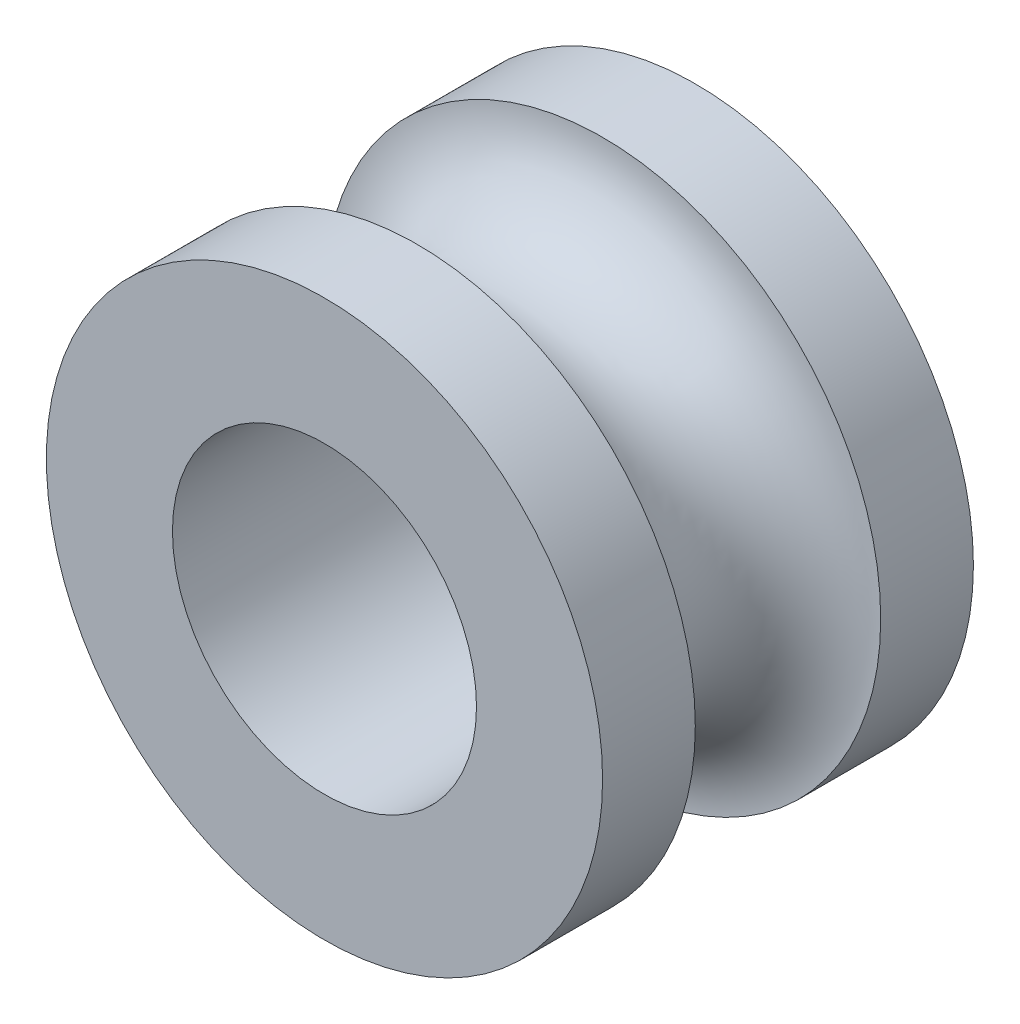
ISO-10303-21;
HEADER;
FILE_DESCRIPTION(('STEP AP214'),'2;1');
FILE_NAME('part.step','',(''),(''),'','','');
FILE_SCHEMA(('AUTOMOTIVE_DESIGN { 1 0 10303 214 1 1 1 1 }'));
ENDSEC;
DATA;
#1=APPLICATION_CONTEXT('core data for automotive mechanical design processes');
#2=APPLICATION_PROTOCOL_DEFINITION('international standard','automotive_design',2000,#1);
#3=PRODUCT_CONTEXT('',#1,'mechanical');
#4=PRODUCT('Part','Part','',(#3));
#5=PRODUCT_RELATED_PRODUCT_CATEGORY('part','',(#4));
#6=PRODUCT_DEFINITION_FORMATION('','',#4);
#7=PRODUCT_DEFINITION_CONTEXT('part definition',#1,'design');
#8=PRODUCT_DEFINITION('design','',#6,#7);
#9=PRODUCT_DEFINITION_SHAPE('','',#8);
#10=(LENGTH_UNIT() NAMED_UNIT(*) SI_UNIT(.MILLI.,.METRE.));
#11=(NAMED_UNIT(*) PLANE_ANGLE_UNIT() SI_UNIT($,.RADIAN.));
#12=(NAMED_UNIT(*) SI_UNIT($,.STERADIAN.) SOLID_ANGLE_UNIT());
#13=UNCERTAINTY_MEASURE_WITH_UNIT(LENGTH_MEASURE(1.E-05),#10,'distance_accuracy_value','');
#14=(GEOMETRIC_REPRESENTATION_CONTEXT(3) GLOBAL_UNCERTAINTY_ASSIGNED_CONTEXT((#13)) GLOBAL_UNIT_ASSIGNED_CONTEXT((#10,
#11,#12)) REPRESENTATION_CONTEXT('',''));
#15=CARTESIAN_POINT('',(0.,0.,0.));
#16=DIRECTION('',(0.,0.,1.));
#17=DIRECTION('',(1.,0.,0.));
#18=AXIS2_PLACEMENT_3D('',#15,#16,#17);
#19=CARTESIAN_POINT('',(0.,0.,2.5));
#20=DIRECTION('',(0.,0.,-1.));
#21=DIRECTION('',(-1.,0.,0.));
#22=AXIS2_PLACEMENT_3D('',#19,#20,#21);
#23=CYLINDRICAL_SURFACE('',#22,3.75);
#24=CARTESIAN_POINT('',(0.,0.,1.25));
#25=DIRECTION('',(0.,0.,-1.));
#26=DIRECTION('',(-1.,0.,0.));
#27=AXIS2_PLACEMENT_3D('',#24,#25,#26);
#28=CIRCLE('',#27,3.75);
#29=CARTESIAN_POINT('',(3.75,0.,1.25));
#30=VERTEX_POINT('',#29);
#31=EDGE_CURVE('E12',#30,#30,#28,.F.);
#32=ORIENTED_EDGE('',*,*,#31,.T.);
#33=EDGE_LOOP('',(#32));
#34=FACE_BOUND('',#33,.T.);
#35=CARTESIAN_POINT('',(0.,0.,2.5));
#36=DIRECTION('',(0.,0.,1.));
#37=DIRECTION('',(1.,0.,0.));
#38=AXIS2_PLACEMENT_3D('',#35,#36,#37);
#39=CIRCLE('',#38,3.75);
#40=CARTESIAN_POINT('',(3.75,0.,2.5));
#41=VERTEX_POINT('',#40);
#42=EDGE_CURVE('E74',#41,#41,#39,.T.);
#43=ORIENTED_EDGE('',*,*,#42,.F.);
#44=EDGE_LOOP('',(#43));
#45=FACE_BOUND('',#44,.T.);
#46=ADVANCED_FACE('F47',(#34,#45),#23,.T.);
#47=CARTESIAN_POINT('',(0.,0.,2.5));
#48=DIRECTION('',(0.,0.,1.));
#49=DIRECTION('',(1.,0.,0.));
#50=AXIS2_PLACEMENT_3D('',#47,#48,#49);
#51=PLANE('',#50);
#52=ORIENTED_EDGE('',*,*,#42,.T.);
#53=EDGE_LOOP('',(#52));
#54=FACE_BOUND('',#53,.T.);
#55=CARTESIAN_POINT('',(0.,0.,2.5));
#56=DIRECTION('',(0.,0.,1.));
#57=DIRECTION('',(1.,0.,0.));
#58=AXIS2_PLACEMENT_3D('',#55,#56,#57);
#59=CIRCLE('',#58,2.05);
#60=CARTESIAN_POINT('',(2.05,0.,2.5));
#61=VERTEX_POINT('',#60);
#62=EDGE_CURVE('E68',#61,#61,#59,.T.);
#63=ORIENTED_EDGE('',*,*,#62,.F.);
#64=EDGE_LOOP('',(#63));
#65=FACE_BOUND('',#64,.T.);
#66=ADVANCED_FACE('F87',(#54,#65),#51,.T.);
#67=CARTESIAN_POINT('',(0.,0.,-2.5));
#68=DIRECTION('',(0.,0.,1.));
#69=DIRECTION('',(1.,0.,0.));
#70=AXIS2_PLACEMENT_3D('',#67,#68,#69);
#71=PLANE('',#70);
#72=CARTESIAN_POINT('',(0.,0.,-2.5));
#73=DIRECTION('',(0.,0.,1.));
#74=DIRECTION('',(1.,0.,0.));
#75=AXIS2_PLACEMENT_3D('',#72,#73,#74);
#76=CIRCLE('',#75,3.75);
#77=CARTESIAN_POINT('',(3.75,0.,-2.5));
#78=VERTEX_POINT('',#77);
#79=EDGE_CURVE('E72',#78,#78,#76,.T.);
#80=ORIENTED_EDGE('',*,*,#79,.F.);
#81=EDGE_LOOP('',(#80));
#82=FACE_BOUND('',#81,.T.);
#83=CARTESIAN_POINT('',(0.,0.,-2.5));
#84=DIRECTION('',(0.,0.,1.));
#85=DIRECTION('',(1.,0.,0.));
#86=AXIS2_PLACEMENT_3D('',#83,#84,#85);
#87=CIRCLE('',#86,2.05);
#88=CARTESIAN_POINT('',(2.05,0.,-2.5));
#89=VERTEX_POINT('',#88);
#90=EDGE_CURVE('E65',#89,#89,#87,.T.);
#91=ORIENTED_EDGE('',*,*,#90,.T.);
#92=EDGE_LOOP('',(#91));
#93=FACE_BOUND('',#92,.T.);
#94=ADVANCED_FACE('F82',(#82,#93),#71,.F.);
#95=CARTESIAN_POINT('',(0.,0.,-1.25));
#96=DIRECTION('',(0.,0.,1.));
#97=DIRECTION('',(1.,0.,0.));
#98=AXIS2_PLACEMENT_3D('',#95,#96,#97);
#99=CIRCLE('',#98,3.75);
#100=CARTESIAN_POINT('',(3.75,0.,-1.25));
#101=VERTEX_POINT('',#100);
#102=EDGE_CURVE('E55',#101,#101,#99,.F.);
#103=ORIENTED_EDGE('',*,*,#102,.T.);
#104=EDGE_LOOP('',(#103));
#105=FACE_BOUND('',#104,.T.);
#106=ORIENTED_EDGE('',*,*,#79,.T.);
#107=EDGE_LOOP('',(#106));
#108=FACE_BOUND('',#107,.T.);
#109=ADVANCED_FACE('F49',(#105,#108),#23,.T.);
#110=CARTESIAN_POINT('',(0.,0.,2.5));
#111=DIRECTION('',(0.,0.,-1.));
#112=DIRECTION('',(-1.,0.,0.));
#113=AXIS2_PLACEMENT_3D('',#110,#111,#112);
#114=CYLINDRICAL_SURFACE('',#113,2.05);
#115=ORIENTED_EDGE('',*,*,#62,.T.);
#116=EDGE_LOOP('',(#115));
#117=FACE_BOUND('',#116,.T.);
#118=ORIENTED_EDGE('',*,*,#90,.F.);
#119=EDGE_LOOP('',(#118));
#120=FACE_BOUND('',#119,.T.);
#121=ADVANCED_FACE('F81',(#117,#120),#114,.F.);
#122=CARTESIAN_POINT('',(0.,0.,0.));
#123=DIRECTION('',(0.,0.,1.));
#124=DIRECTION('',(1.,0.,0.));
#125=AXIS2_PLACEMENT_3D('',#122,#123,#124);
#126=TOROIDAL_SURFACE('',#125,3.75,1.25);
#127=CARTESIAN_POINT('',(3.75,0.,0.));
#128=DIRECTION('',(0.,1.,0.));
#129=DIRECTION('',(-1.,0.,0.));
#130=AXIS2_PLACEMENT_3D('',#127,#128,#129);
#131=CIRCLE('',#130,1.25);
#132=EDGE_CURVE('E62',#101,#30,#131,.T.);
#133=ORIENTED_EDGE('',*,*,#132,.F.);
#134=ORIENTED_EDGE('',*,*,#102,.F.);
#135=ORIENTED_EDGE('',*,*,#132,.T.);
#136=ORIENTED_EDGE('',*,*,#31,.F.);
#137=EDGE_LOOP('',(#133,#134,#135,#136));
#138=FACE_BOUND('',#137,.T.);
#139=ADVANCED_FACE('F63',(#138),#126,.F.);
#140=CLOSED_SHELL('',(#46,#66,#94,#109,#121,#139));
#141=MANIFOLD_SOLID_BREP('B2',#140);
#142=ADVANCED_BREP_SHAPE_REPRESENTATION('',(#18,#141),#14);
#143=SHAPE_DEFINITION_REPRESENTATION(#9,#142);
ENDSEC;
END-ISO-10303-21;
